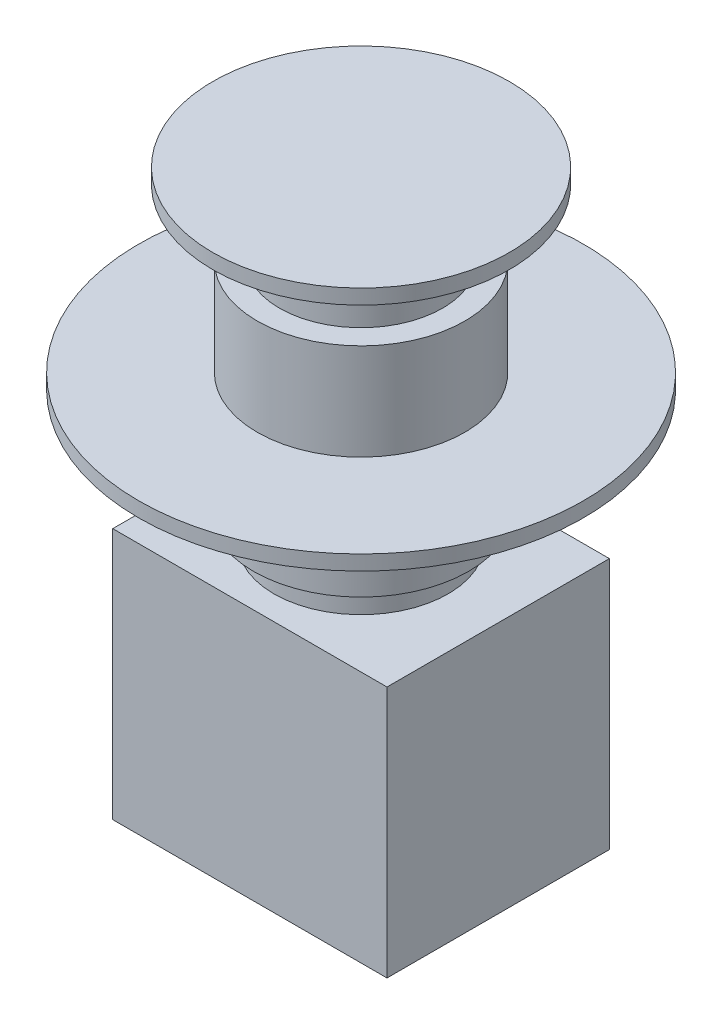
ISO-10303-21;
HEADER;
FILE_DESCRIPTION(('STEP AP214'),'2;1');
FILE_NAME('part.step','',(''),(''),'','','');
FILE_SCHEMA(('AUTOMOTIVE_DESIGN { 1 0 10303 214 1 1 1 1 }'));
ENDSEC;
DATA;
#1=APPLICATION_CONTEXT('core data for automotive mechanical design processes');
#2=APPLICATION_PROTOCOL_DEFINITION('international standard','automotive_design',2000,#1);
#3=PRODUCT_CONTEXT('',#1,'mechanical');
#4=PRODUCT('Part','Part','',(#3));
#5=PRODUCT_RELATED_PRODUCT_CATEGORY('part','',(#4));
#6=PRODUCT_DEFINITION_FORMATION('','',#4);
#7=PRODUCT_DEFINITION_CONTEXT('part definition',#1,'design');
#8=PRODUCT_DEFINITION('design','',#6,#7);
#9=PRODUCT_DEFINITION_SHAPE('','',#8);
#10=(LENGTH_UNIT() NAMED_UNIT(*) SI_UNIT(.MILLI.,.METRE.));
#11=(NAMED_UNIT(*) PLANE_ANGLE_UNIT() SI_UNIT($,.RADIAN.));
#12=(NAMED_UNIT(*) SI_UNIT($,.STERADIAN.) SOLID_ANGLE_UNIT());
#13=UNCERTAINTY_MEASURE_WITH_UNIT(LENGTH_MEASURE(1.E-05),#10,'distance_accuracy_value','');
#14=(GEOMETRIC_REPRESENTATION_CONTEXT(3) GLOBAL_UNCERTAINTY_ASSIGNED_CONTEXT((#13)) GLOBAL_UNIT_ASSIGNED_CONTEXT((#10,
#11,#12)) REPRESENTATION_CONTEXT('',''));
#15=CARTESIAN_POINT('',(0.,0.,0.));
#16=DIRECTION('',(0.,0.,1.));
#17=DIRECTION('',(1.,0.,0.));
#18=AXIS2_PLACEMENT_3D('',#15,#16,#17);
#19=CARTESIAN_POINT('',(-18.5,34.,15.));
#20=DIRECTION('',(1.,0.,0.));
#21=DIRECTION('',(0.,0.,-1.));
#22=AXIS2_PLACEMENT_3D('',#19,#20,#21);
#23=PLANE('',#22);
#24=DIRECTION('',(0.,0.,1.));
#25=VECTOR('',#24,1.);
#26=CARTESIAN_POINT('',(-18.5,0.,15.));
#27=LINE('',#26,#25);
#28=CARTESIAN_POINT('',(-18.5,0.,-15.));
#29=VERTEX_POINT('',#28);
#30=CARTESIAN_POINT('',(-18.5,0.,15.));
#31=VERTEX_POINT('',#30);
#32=EDGE_CURVE('E100',#29,#31,#27,.T.);
#33=ORIENTED_EDGE('',*,*,#32,.T.);
#34=DIRECTION('',(0.,-1.,0.));
#35=VECTOR('',#34,1.);
#36=CARTESIAN_POINT('',(-18.5,34.,15.));
#37=LINE('',#36,#35);
#38=CARTESIAN_POINT('',(-18.5,34.,15.));
#39=VERTEX_POINT('',#38);
#40=EDGE_CURVE('E36',#39,#31,#37,.T.);
#41=ORIENTED_EDGE('',*,*,#40,.F.);
#42=DIRECTION('',(0.,0.,1.));
#43=VECTOR('',#42,1.);
#44=CARTESIAN_POINT('',(-18.5,34.,15.));
#45=LINE('',#44,#43);
#46=CARTESIAN_POINT('',(-18.5,34.,-15.));
#47=VERTEX_POINT('',#46);
#48=EDGE_CURVE('E87',#47,#39,#45,.T.);
#49=ORIENTED_EDGE('',*,*,#48,.F.);
#50=DIRECTION('',(0.,-1.,0.));
#51=VECTOR('',#50,1.);
#52=CARTESIAN_POINT('',(-18.5,34.,-15.));
#53=LINE('',#52,#51);
#54=EDGE_CURVE('E96',#47,#29,#53,.T.);
#55=ORIENTED_EDGE('',*,*,#54,.T.);
#56=EDGE_LOOP('',(#33,#41,#49,#55));
#57=FACE_BOUND('',#56,.T.);
#58=ADVANCED_FACE('F33',(#57),#23,.F.);
#59=CARTESIAN_POINT('',(18.5,34.,15.));
#60=DIRECTION('',(0.,0.,-1.));
#61=DIRECTION('',(-1.,0.,0.));
#62=AXIS2_PLACEMENT_3D('',#59,#60,#61);
#63=PLANE('',#62);
#64=DIRECTION('',(1.,0.,0.));
#65=VECTOR('',#64,1.);
#66=CARTESIAN_POINT('',(18.5,0.,15.));
#67=LINE('',#66,#65);
#68=CARTESIAN_POINT('',(18.5,0.,15.));
#69=VERTEX_POINT('',#68);
#70=EDGE_CURVE('E92',#31,#69,#67,.T.);
#71=ORIENTED_EDGE('',*,*,#70,.T.);
#72=DIRECTION('',(0.,-1.,0.));
#73=VECTOR('',#72,1.);
#74=CARTESIAN_POINT('',(18.5,34.,15.));
#75=LINE('',#74,#73);
#76=CARTESIAN_POINT('',(18.5,34.,15.));
#77=VERTEX_POINT('',#76);
#78=EDGE_CURVE('E90',#77,#69,#75,.T.);
#79=ORIENTED_EDGE('',*,*,#78,.F.);
#80=DIRECTION('',(1.,0.,0.));
#81=VECTOR('',#80,1.);
#82=CARTESIAN_POINT('',(18.5,34.,15.));
#83=LINE('',#82,#81);
#84=EDGE_CURVE('E82',#39,#77,#83,.T.);
#85=ORIENTED_EDGE('',*,*,#84,.F.);
#86=ORIENTED_EDGE('',*,*,#40,.T.);
#87=EDGE_LOOP('',(#71,#79,#85,#86));
#88=FACE_BOUND('',#87,.T.);
#89=ADVANCED_FACE('F91',(#88),#63,.F.);
#90=CARTESIAN_POINT('',(18.5,34.,15.));
#91=DIRECTION('',(-1.,0.,0.));
#92=DIRECTION('',(0.,0.,1.));
#93=AXIS2_PLACEMENT_3D('',#90,#91,#92);
#94=PLANE('',#93);
#95=DIRECTION('',(0.,0.,-1.));
#96=VECTOR('',#95,1.);
#97=CARTESIAN_POINT('',(18.5,0.,15.));
#98=LINE('',#97,#96);
#99=CARTESIAN_POINT('',(18.5,0.,-15.));
#100=VERTEX_POINT('',#99);
#101=EDGE_CURVE('E68',#69,#100,#98,.T.);
#102=ORIENTED_EDGE('',*,*,#101,.T.);
#103=DIRECTION('',(0.,-1.,0.));
#104=VECTOR('',#103,1.);
#105=CARTESIAN_POINT('',(18.5,34.,-15.));
#106=LINE('',#105,#104);
#107=CARTESIAN_POINT('',(18.5,34.,-15.));
#108=VERTEX_POINT('',#107);
#109=EDGE_CURVE('E93',#108,#100,#106,.T.);
#110=ORIENTED_EDGE('',*,*,#109,.F.);
#111=DIRECTION('',(0.,0.,-1.));
#112=VECTOR('',#111,1.);
#113=CARTESIAN_POINT('',(18.5,34.,15.));
#114=LINE('',#113,#112);
#115=EDGE_CURVE('E85',#77,#108,#114,.T.);
#116=ORIENTED_EDGE('',*,*,#115,.F.);
#117=ORIENTED_EDGE('',*,*,#78,.T.);
#118=EDGE_LOOP('',(#102,#110,#116,#117));
#119=FACE_BOUND('',#118,.T.);
#120=ADVANCED_FACE('F94',(#119),#94,.F.);
#121=CARTESIAN_POINT('',(18.5,34.,-15.));
#122=DIRECTION('',(0.,0.,1.));
#123=DIRECTION('',(1.,0.,0.));
#124=AXIS2_PLACEMENT_3D('',#121,#122,#123);
#125=PLANE('',#124);
#126=DIRECTION('',(-1.,0.,0.));
#127=VECTOR('',#126,1.);
#128=CARTESIAN_POINT('',(18.5,0.,-15.));
#129=LINE('',#128,#127);
#130=EDGE_CURVE('E74',#100,#29,#129,.T.);
#131=ORIENTED_EDGE('',*,*,#130,.T.);
#132=ORIENTED_EDGE('',*,*,#54,.F.);
#133=DIRECTION('',(-1.,0.,0.));
#134=VECTOR('',#133,1.);
#135=CARTESIAN_POINT('',(18.5,34.,-15.));
#136=LINE('',#135,#134);
#137=EDGE_CURVE('E51',#108,#47,#136,.T.);
#138=ORIENTED_EDGE('',*,*,#137,.F.);
#139=ORIENTED_EDGE('',*,*,#109,.T.);
#140=EDGE_LOOP('',(#131,#132,#138,#139));
#141=FACE_BOUND('',#140,.T.);
#142=ADVANCED_FACE('F108',(#141),#125,.F.);
#143=CARTESIAN_POINT('',(0.,34.,0.));
#144=DIRECTION('',(0.,1.,0.));
#145=DIRECTION('',(0.,0.,1.));
#146=AXIS2_PLACEMENT_3D('',#143,#144,#145);
#147=PLANE('',#146);
#148=CARTESIAN_POINT('',(0.,34.,0.));
#149=DIRECTION('',(0.,1.,0.));
#150=DIRECTION('',(0.,0.,1.));
#151=AXIS2_PLACEMENT_3D('',#148,#149,#150);
#152=CIRCLE('',#151,11.75);
#153=CARTESIAN_POINT('',(0.,34.,11.75));
#154=VERTEX_POINT('',#153);
#155=EDGE_CURVE('E114',#154,#154,#152,.T.);
#156=ORIENTED_EDGE('',*,*,#155,.F.);
#157=EDGE_LOOP('',(#156));
#158=FACE_BOUND('',#157,.T.);
#159=ORIENTED_EDGE('',*,*,#48,.T.);
#160=ORIENTED_EDGE('',*,*,#84,.T.);
#161=ORIENTED_EDGE('',*,*,#115,.T.);
#162=ORIENTED_EDGE('',*,*,#137,.T.);
#163=EDGE_LOOP('',(#159,#160,#161,#162));
#164=FACE_BOUND('',#163,.T.);
#165=ADVANCED_FACE('F83',(#158,#164),#147,.T.);
#166=CARTESIAN_POINT('',(0.,0.,0.));
#167=DIRECTION('',(0.,1.,0.));
#168=DIRECTION('',(0.,0.,1.));
#169=AXIS2_PLACEMENT_3D('',#166,#167,#168);
#170=PLANE('',#169);
#171=ORIENTED_EDGE('',*,*,#32,.F.);
#172=ORIENTED_EDGE('',*,*,#130,.F.);
#173=ORIENTED_EDGE('',*,*,#101,.F.);
#174=ORIENTED_EDGE('',*,*,#70,.F.);
#175=EDGE_LOOP('',(#171,#172,#173,#174));
#176=FACE_BOUND('',#175,.T.);
#177=ADVANCED_FACE('F111',(#176),#170,.F.);
#178=CARTESIAN_POINT('',(0.,38.,0.));
#179=DIRECTION('',(0.,-1.,0.));
#180=DIRECTION('',(0.,0.,-1.));
#181=AXIS2_PLACEMENT_3D('',#178,#179,#180);
#182=CYLINDRICAL_SURFACE('',#181,11.75);
#183=CARTESIAN_POINT('',(0.,38.,0.));
#184=DIRECTION('',(0.,1.,0.));
#185=DIRECTION('',(0.,0.,1.));
#186=AXIS2_PLACEMENT_3D('',#183,#184,#185);
#187=CIRCLE('',#186,11.75);
#188=CARTESIAN_POINT('',(0.,38.,11.75));
#189=VERTEX_POINT('',#188);
#190=EDGE_CURVE('E103',#189,#189,#187,.T.);
#191=ORIENTED_EDGE('',*,*,#190,.F.);
#192=EDGE_LOOP('',(#191));
#193=FACE_BOUND('',#192,.T.);
#194=ORIENTED_EDGE('',*,*,#155,.T.);
#195=EDGE_LOOP('',(#194));
#196=FACE_BOUND('',#195,.T.);
#197=ADVANCED_FACE('F188',(#193,#196),#182,.T.);
#198=CARTESIAN_POINT('',(0.,46.,0.));
#199=DIRECTION('',(0.,-1.,0.));
#200=DIRECTION('',(0.,0.,-1.));
#201=AXIS2_PLACEMENT_3D('',#198,#199,#200);
#202=CYLINDRICAL_SURFACE('',#201,14.5);
#203=CARTESIAN_POINT('',(0.,46.,0.));
#204=DIRECTION('',(0.,1.,0.));
#205=DIRECTION('',(0.,0.,1.));
#206=AXIS2_PLACEMENT_3D('',#203,#204,#205);
#207=CIRCLE('',#206,14.5);
#208=CARTESIAN_POINT('',(0.,46.,14.5));
#209=VERTEX_POINT('',#208);
#210=EDGE_CURVE('E120',#209,#209,#207,.T.);
#211=ORIENTED_EDGE('',*,*,#210,.F.);
#212=EDGE_LOOP('',(#211));
#213=FACE_BOUND('',#212,.T.);
#214=CARTESIAN_POINT('',(0.,38.,0.));
#215=DIRECTION('',(0.,1.,0.));
#216=DIRECTION('',(0.,0.,1.));
#217=AXIS2_PLACEMENT_3D('',#214,#215,#216);
#218=CIRCLE('',#217,14.5);
#219=CARTESIAN_POINT('',(0.,38.,14.5));
#220=VERTEX_POINT('',#219);
#221=EDGE_CURVE('E121',#220,#220,#218,.T.);
#222=ORIENTED_EDGE('',*,*,#221,.T.);
#223=EDGE_LOOP('',(#222));
#224=FACE_BOUND('',#223,.T.);
#225=ADVANCED_FACE('F194',(#213,#224),#202,.T.);
#226=CARTESIAN_POINT('',(0.,46.,0.));
#227=DIRECTION('',(0.,1.,0.));
#228=DIRECTION('',(0.,0.,1.));
#229=AXIS2_PLACEMENT_3D('',#226,#227,#228);
#230=PLANE('',#229);
#231=CARTESIAN_POINT('',(0.,46.,0.));
#232=DIRECTION('',(0.,1.,0.));
#233=DIRECTION('',(0.,0.,1.));
#234=AXIS2_PLACEMENT_3D('',#231,#232,#233);
#235=CIRCLE('',#234,13.);
#236=CARTESIAN_POINT('',(0.,46.,13.));
#237=VERTEX_POINT('',#236);
#238=EDGE_CURVE('E117',#237,#237,#235,.T.);
#239=ORIENTED_EDGE('',*,*,#238,.F.);
#240=EDGE_LOOP('',(#239));
#241=FACE_BOUND('',#240,.T.);
#242=ORIENTED_EDGE('',*,*,#210,.T.);
#243=EDGE_LOOP('',(#242));
#244=FACE_BOUND('',#243,.T.);
#245=ADVANCED_FACE('F198',(#241,#244),#230,.T.);
#246=CARTESIAN_POINT('',(0.,38.,0.));
#247=DIRECTION('',(0.,1.,0.));
#248=DIRECTION('',(0.,0.,1.));
#249=AXIS2_PLACEMENT_3D('',#246,#247,#248);
#250=PLANE('',#249);
#251=ORIENTED_EDGE('',*,*,#190,.T.);
#252=EDGE_LOOP('',(#251));
#253=FACE_BOUND('',#252,.T.);
#254=ORIENTED_EDGE('',*,*,#221,.F.);
#255=EDGE_LOOP('',(#254));
#256=FACE_BOUND('',#255,.T.);
#257=ADVANCED_FACE('F200',(#253,#256),#250,.F.);
#258=CARTESIAN_POINT('',(0.,47.,0.));
#259=DIRECTION('',(0.,-1.,0.));
#260=DIRECTION('',(0.,0.,-1.));
#261=AXIS2_PLACEMENT_3D('',#258,#259,#260);
#262=CYLINDRICAL_SURFACE('',#261,13.);
#263=CARTESIAN_POINT('',(0.,47.,0.));
#264=DIRECTION('',(0.,1.,0.));
#265=DIRECTION('',(0.,0.,1.));
#266=AXIS2_PLACEMENT_3D('',#263,#264,#265);
#267=CIRCLE('',#266,13.);
#268=CARTESIAN_POINT('',(0.,47.,13.));
#269=VERTEX_POINT('',#268);
#270=EDGE_CURVE('E124',#269,#269,#267,.T.);
#271=ORIENTED_EDGE('',*,*,#270,.F.);
#272=EDGE_LOOP('',(#271));
#273=FACE_BOUND('',#272,.T.);
#274=ORIENTED_EDGE('',*,*,#238,.T.);
#275=EDGE_LOOP('',(#274));
#276=FACE_BOUND('',#275,.T.);
#277=ADVANCED_FACE('F203',(#273,#276),#262,.T.);
#278=CARTESIAN_POINT('',(0.,47.,0.));
#279=DIRECTION('',(0.,1.,0.));
#280=DIRECTION('',(0.,0.,1.));
#281=AXIS2_PLACEMENT_3D('',#278,#279,#280);
#282=PLANE('',#281);
#283=CARTESIAN_POINT('',(0.,47.,0.));
#284=DIRECTION('',(0.,1.,0.));
#285=DIRECTION('',(0.,0.,1.));
#286=AXIS2_PLACEMENT_3D('',#283,#284,#285);
#287=CIRCLE('',#286,11.);
#288=CARTESIAN_POINT('',(0.,47.,11.));
#289=VERTEX_POINT('',#288);
#290=EDGE_CURVE('E129',#289,#289,#287,.T.);
#291=ORIENTED_EDGE('',*,*,#290,.F.);
#292=EDGE_LOOP('',(#291));
#293=FACE_BOUND('',#292,.T.);
#294=ORIENTED_EDGE('',*,*,#270,.T.);
#295=EDGE_LOOP('',(#294));
#296=FACE_BOUND('',#295,.T.);
#297=ADVANCED_FACE('F210',(#293,#296),#282,.T.);
#298=CARTESIAN_POINT('',(0.,52.,0.));
#299=DIRECTION('',(0.,-1.,0.));
#300=DIRECTION('',(0.,0.,-1.));
#301=AXIS2_PLACEMENT_3D('',#298,#299,#300);
#302=CYLINDRICAL_SURFACE('',#301,11.);
#303=CARTESIAN_POINT('',(0.,52.,0.));
#304=DIRECTION('',(0.,1.,0.));
#305=DIRECTION('',(0.,0.,1.));
#306=AXIS2_PLACEMENT_3D('',#303,#304,#305);
#307=CIRCLE('',#306,11.);
#308=CARTESIAN_POINT('',(0.,52.,11.));
#309=VERTEX_POINT('',#308);
#310=EDGE_CURVE('E132',#309,#309,#307,.T.);
#311=ORIENTED_EDGE('',*,*,#310,.F.);
#312=EDGE_LOOP('',(#311));
#313=FACE_BOUND('',#312,.T.);
#314=ORIENTED_EDGE('',*,*,#290,.T.);
#315=EDGE_LOOP('',(#314));
#316=FACE_BOUND('',#315,.T.);
#317=ADVANCED_FACE('F214',(#313,#316),#302,.T.);
#318=CARTESIAN_POINT('',(0.,54.,0.));
#319=DIRECTION('',(0.,-1.,0.));
#320=DIRECTION('',(0.,0.,-1.));
#321=AXIS2_PLACEMENT_3D('',#318,#319,#320);
#322=CYLINDRICAL_SURFACE('',#321,30.);
#323=CARTESIAN_POINT('',(0.,54.,0.));
#324=DIRECTION('',(0.,1.,0.));
#325=DIRECTION('',(0.,0.,1.));
#326=AXIS2_PLACEMENT_3D('',#323,#324,#325);
#327=CIRCLE('',#326,30.);
#328=CARTESIAN_POINT('',(0.,54.,30.));
#329=VERTEX_POINT('',#328);
#330=EDGE_CURVE('E137',#329,#329,#327,.T.);
#331=ORIENTED_EDGE('',*,*,#330,.F.);
#332=EDGE_LOOP('',(#331));
#333=FACE_BOUND('',#332,.T.);
#334=CARTESIAN_POINT('',(0.,52.,0.));
#335=DIRECTION('',(0.,1.,0.));
#336=DIRECTION('',(0.,0.,1.));
#337=AXIS2_PLACEMENT_3D('',#334,#335,#336);
#338=CIRCLE('',#337,30.);
#339=CARTESIAN_POINT('',(0.,52.,30.));
#340=VERTEX_POINT('',#339);
#341=EDGE_CURVE('E138',#340,#340,#338,.T.);
#342=ORIENTED_EDGE('',*,*,#341,.T.);
#343=EDGE_LOOP('',(#342));
#344=FACE_BOUND('',#343,.T.);
#345=ADVANCED_FACE('F218',(#333,#344),#322,.T.);
#346=CARTESIAN_POINT('',(0.,54.,0.));
#347=DIRECTION('',(0.,1.,0.));
#348=DIRECTION('',(0.,0.,1.));
#349=AXIS2_PLACEMENT_3D('',#346,#347,#348);
#350=PLANE('',#349);
#351=CARTESIAN_POINT('',(0.,54.,0.));
#352=DIRECTION('',(0.,1.,0.));
#353=DIRECTION('',(0.,0.,1.));
#354=AXIS2_PLACEMENT_3D('',#351,#352,#353);
#355=CIRCLE('',#354,14.);
#356=CARTESIAN_POINT('',(0.,54.,14.));
#357=VERTEX_POINT('',#356);
#358=EDGE_CURVE('E42',#357,#357,#355,.T.);
#359=ORIENTED_EDGE('',*,*,#358,.F.);
#360=EDGE_LOOP('',(#359));
#361=FACE_BOUND('',#360,.T.);
#362=ORIENTED_EDGE('',*,*,#330,.T.);
#363=EDGE_LOOP('',(#362));
#364=FACE_BOUND('',#363,.T.);
#365=ADVANCED_FACE('F222',(#361,#364),#350,.T.);
#366=CARTESIAN_POINT('',(0.,52.,0.));
#367=DIRECTION('',(0.,1.,0.));
#368=DIRECTION('',(0.,0.,1.));
#369=AXIS2_PLACEMENT_3D('',#366,#367,#368);
#370=PLANE('',#369);
#371=ORIENTED_EDGE('',*,*,#310,.T.);
#372=EDGE_LOOP('',(#371));
#373=FACE_BOUND('',#372,.T.);
#374=ORIENTED_EDGE('',*,*,#341,.F.);
#375=EDGE_LOOP('',(#374));
#376=FACE_BOUND('',#375,.T.);
#377=ADVANCED_FACE('F224',(#373,#376),#370,.F.);
#378=CARTESIAN_POINT('',(0.,67.,0.));
#379=DIRECTION('',(0.,-1.,0.));
#380=DIRECTION('',(0.,0.,-1.));
#381=AXIS2_PLACEMENT_3D('',#378,#379,#380);
#382=CYLINDRICAL_SURFACE('',#381,14.);
#383=CARTESIAN_POINT('',(0.,67.,0.));
#384=DIRECTION('',(0.,1.,0.));
#385=DIRECTION('',(0.,0.,1.));
#386=AXIS2_PLACEMENT_3D('',#383,#384,#385);
#387=CIRCLE('',#386,14.);
#388=CARTESIAN_POINT('',(0.,67.,14.));
#389=VERTEX_POINT('',#388);
#390=EDGE_CURVE('E141',#389,#389,#387,.T.);
#391=ORIENTED_EDGE('',*,*,#390,.F.);
#392=EDGE_LOOP('',(#391));
#393=FACE_BOUND('',#392,.T.);
#394=ORIENTED_EDGE('',*,*,#358,.T.);
#395=EDGE_LOOP('',(#394));
#396=FACE_BOUND('',#395,.T.);
#397=ADVANCED_FACE('F227',(#393,#396),#382,.T.);
#398=CARTESIAN_POINT('',(0.,67.,0.));
#399=DIRECTION('',(0.,1.,0.));
#400=DIRECTION('',(0.,0.,1.));
#401=AXIS2_PLACEMENT_3D('',#398,#399,#400);
#402=PLANE('',#401);
#403=CARTESIAN_POINT('',(0.,67.,0.));
#404=DIRECTION('',(0.,1.,0.));
#405=DIRECTION('',(0.,0.,1.));
#406=AXIS2_PLACEMENT_3D('',#403,#404,#405);
#407=CIRCLE('',#406,11.);
#408=CARTESIAN_POINT('',(0.,67.,11.));
#409=VERTEX_POINT('',#408);
#410=EDGE_CURVE('E11',#409,#409,#407,.T.);
#411=ORIENTED_EDGE('',*,*,#410,.F.);
#412=EDGE_LOOP('',(#411));
#413=FACE_BOUND('',#412,.T.);
#414=ORIENTED_EDGE('',*,*,#390,.T.);
#415=EDGE_LOOP('',(#414));
#416=FACE_BOUND('',#415,.T.);
#417=ADVANCED_FACE('F234',(#413,#416),#402,.T.);
#418=CARTESIAN_POINT('',(0.,76.,0.));
#419=DIRECTION('',(0.,-1.,0.));
#420=DIRECTION('',(0.,0.,-1.));
#421=AXIS2_PLACEMENT_3D('',#418,#419,#420);
#422=CYLINDRICAL_SURFACE('',#421,11.);
#423=CARTESIAN_POINT('',(0.,76.,0.));
#424=DIRECTION('',(0.,1.,0.));
#425=DIRECTION('',(0.,0.,1.));
#426=AXIS2_PLACEMENT_3D('',#423,#424,#425);
#427=CIRCLE('',#426,11.);
#428=CARTESIAN_POINT('',(0.,76.,11.));
#429=VERTEX_POINT('',#428);
#430=EDGE_CURVE('E147',#429,#429,#427,.T.);
#431=ORIENTED_EDGE('',*,*,#430,.F.);
#432=EDGE_LOOP('',(#431));
#433=FACE_BOUND('',#432,.T.);
#434=ORIENTED_EDGE('',*,*,#410,.T.);
#435=EDGE_LOOP('',(#434));
#436=FACE_BOUND('',#435,.T.);
#437=ADVANCED_FACE('F163',(#433,#436),#422,.T.);
#438=CARTESIAN_POINT('',(0.,78.,0.));
#439=DIRECTION('',(0.,-1.,0.));
#440=DIRECTION('',(0.,0.,-1.));
#441=AXIS2_PLACEMENT_3D('',#438,#439,#440);
#442=CYLINDRICAL_SURFACE('',#441,20.);
#443=CARTESIAN_POINT('',(0.,78.,0.));
#444=DIRECTION('',(0.,1.,0.));
#445=DIRECTION('',(0.,0.,1.));
#446=AXIS2_PLACEMENT_3D('',#443,#444,#445);
#447=CIRCLE('',#446,20.);
#448=CARTESIAN_POINT('',(0.,78.,20.));
#449=VERTEX_POINT('',#448);
#450=EDGE_CURVE('E151',#449,#449,#447,.T.);
#451=ORIENTED_EDGE('',*,*,#450,.F.);
#452=EDGE_LOOP('',(#451));
#453=FACE_BOUND('',#452,.T.);
#454=CARTESIAN_POINT('',(0.,76.,0.));
#455=DIRECTION('',(0.,1.,0.));
#456=DIRECTION('',(0.,0.,1.));
#457=AXIS2_PLACEMENT_3D('',#454,#455,#456);
#458=CIRCLE('',#457,20.);
#459=CARTESIAN_POINT('',(0.,76.,20.));
#460=VERTEX_POINT('',#459);
#461=EDGE_CURVE('E152',#460,#460,#458,.T.);
#462=ORIENTED_EDGE('',*,*,#461,.T.);
#463=EDGE_LOOP('',(#462));
#464=FACE_BOUND('',#463,.T.);
#465=ADVANCED_FACE('F160',(#453,#464),#442,.T.);
#466=CARTESIAN_POINT('',(0.,78.,0.));
#467=DIRECTION('',(0.,1.,0.));
#468=DIRECTION('',(0.,0.,1.));
#469=AXIS2_PLACEMENT_3D('',#466,#467,#468);
#470=PLANE('',#469);
#471=ORIENTED_EDGE('',*,*,#450,.T.);
#472=EDGE_LOOP('',(#471));
#473=FACE_BOUND('',#472,.T.);
#474=ADVANCED_FACE('F158',(#473),#470,.T.);
#475=CARTESIAN_POINT('',(0.,76.,0.));
#476=DIRECTION('',(0.,1.,0.));
#477=DIRECTION('',(0.,0.,1.));
#478=AXIS2_PLACEMENT_3D('',#475,#476,#477);
#479=PLANE('',#478);
#480=ORIENTED_EDGE('',*,*,#430,.T.);
#481=EDGE_LOOP('',(#480));
#482=FACE_BOUND('',#481,.T.);
#483=ORIENTED_EDGE('',*,*,#461,.F.);
#484=EDGE_LOOP('',(#483));
#485=FACE_BOUND('',#484,.T.);
#486=ADVANCED_FACE('F167',(#482,#485),#479,.F.);
#487=CLOSED_SHELL('',(#58,#89,#120,#142,#165,#177,#197,#225,#245,#257,#277,#297,#317,#345,#365,
#377,#397,#417,#437,#465,#474,#486));
#488=MANIFOLD_SOLID_BREP('B2',#487);
#489=ADVANCED_BREP_SHAPE_REPRESENTATION('',(#18,#488),#14);
#490=SHAPE_DEFINITION_REPRESENTATION(#9,#489);
ENDSEC;
END-ISO-10303-21;
